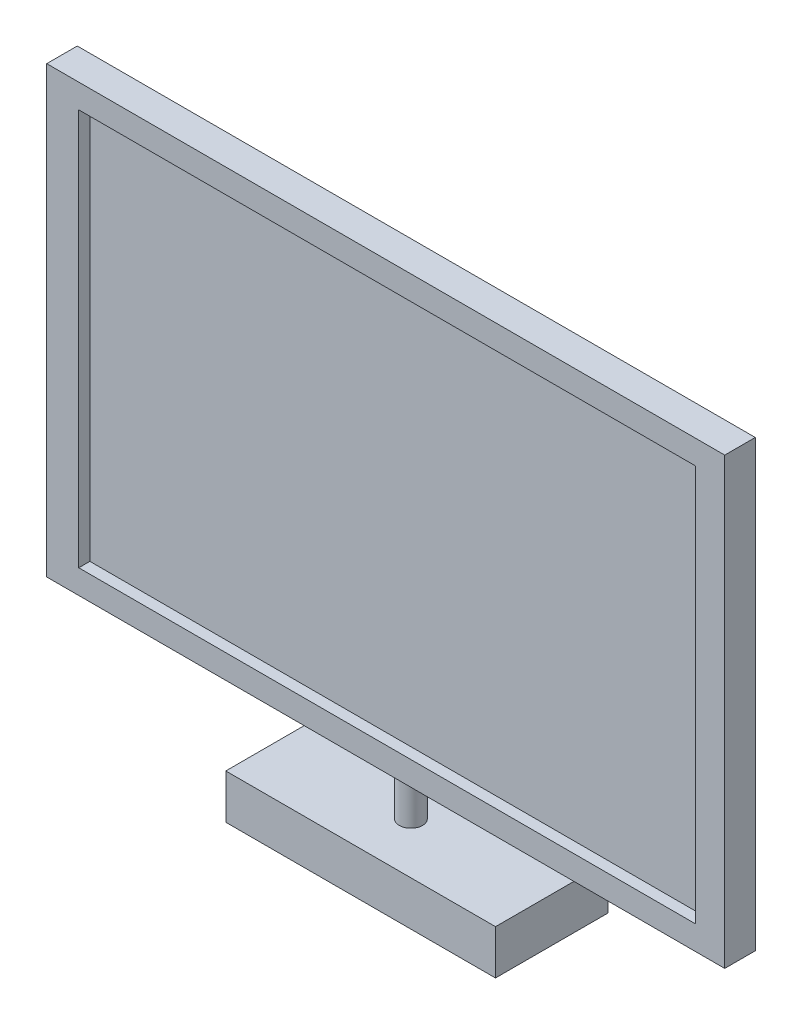
ISO-10303-21;
HEADER;
FILE_DESCRIPTION(('STEP AP214'),'2;1');
FILE_NAME('part.step','',(''),(''),'','','');
FILE_SCHEMA(('AUTOMOTIVE_DESIGN { 1 0 10303 214 1 1 1 1 }'));
ENDSEC;
DATA;
#1=APPLICATION_CONTEXT('core data for automotive mechanical design processes');
#2=APPLICATION_PROTOCOL_DEFINITION('international standard','automotive_design',2000,#1);
#3=PRODUCT_CONTEXT('',#1,'mechanical');
#4=PRODUCT('Part','Part','',(#3));
#5=PRODUCT_RELATED_PRODUCT_CATEGORY('part','',(#4));
#6=PRODUCT_DEFINITION_FORMATION('','',#4);
#7=PRODUCT_DEFINITION_CONTEXT('part definition',#1,'design');
#8=PRODUCT_DEFINITION('design','',#6,#7);
#9=PRODUCT_DEFINITION_SHAPE('','',#8);
#10=(LENGTH_UNIT() NAMED_UNIT(*) SI_UNIT(.MILLI.,.METRE.));
#11=(NAMED_UNIT(*) PLANE_ANGLE_UNIT() SI_UNIT($,.RADIAN.));
#12=(NAMED_UNIT(*) SI_UNIT($,.STERADIAN.) SOLID_ANGLE_UNIT());
#13=UNCERTAINTY_MEASURE_WITH_UNIT(LENGTH_MEASURE(1.E-05),#10,'distance_accuracy_value','');
#14=(GEOMETRIC_REPRESENTATION_CONTEXT(3) GLOBAL_UNCERTAINTY_ASSIGNED_CONTEXT((#13)) GLOBAL_UNIT_ASSIGNED_CONTEXT((#10,
#11,#12)) REPRESENTATION_CONTEXT('',''));
#15=CARTESIAN_POINT('',(0.,0.,0.));
#16=DIRECTION('',(0.,0.,1.));
#17=DIRECTION('',(1.,0.,0.));
#18=AXIS2_PLACEMENT_3D('',#15,#16,#17);
#19=CARTESIAN_POINT('',(549.,0.,0.));
#20=DIRECTION('',(0.,0.,-1.));
#21=DIRECTION('',(-1.,0.,0.));
#22=AXIS2_PLACEMENT_3D('',#19,#20,#21);
#23=PLANE('',#22);
#24=DIRECTION('',(1.,0.,0.));
#25=VECTOR('',#24,1.);
#26=CARTESIAN_POINT('',(25.920914996524,19.4294060743443,0.));
#27=LINE('',#26,#25);
#28=CARTESIAN_POINT('',(25.920914996524,19.4294060743443,0.));
#29=VERTEX_POINT('',#28);
#30=CARTESIAN_POINT('',(525.234394989055,19.4294060743443,0.));
#31=VERTEX_POINT('',#30);
#32=EDGE_CURVE('E179',#29,#31,#27,.T.);
#33=ORIENTED_EDGE('',*,*,#32,.F.);
#34=DIRECTION('',(0.,-1.,0.));
#35=VECTOR('',#34,1.);
#36=CARTESIAN_POINT('',(25.920914996524,340.570593925656,0.));
#37=LINE('',#36,#35);
#38=CARTESIAN_POINT('',(25.920914996524,340.570593925656,0.));
#39=VERTEX_POINT('',#38);
#40=EDGE_CURVE('E47',#39,#29,#37,.T.);
#41=ORIENTED_EDGE('',*,*,#40,.F.);
#42=DIRECTION('',(-1.,0.,0.));
#43=VECTOR('',#42,1.);
#44=CARTESIAN_POINT('',(25.920914996524,340.570593925656,0.));
#45=LINE('',#44,#43);
#46=CARTESIAN_POINT('',(525.234394989055,340.570593925656,0.));
#47=VERTEX_POINT('',#46);
#48=EDGE_CURVE('E168',#47,#39,#45,.T.);
#49=ORIENTED_EDGE('',*,*,#48,.F.);
#50=DIRECTION('',(0.,1.,0.));
#51=VECTOR('',#50,1.);
#52=CARTESIAN_POINT('',(525.234394989055,340.570593925656,0.));
#53=LINE('',#52,#51);
#54=EDGE_CURVE('E182',#31,#47,#53,.T.);
#55=ORIENTED_EDGE('',*,*,#54,.F.);
#56=EDGE_LOOP('',(#33,#41,#49,#55));
#57=FACE_BOUND('',#56,.T.);
#58=DIRECTION('',(0.,-1.,0.));
#59=VECTOR('',#58,1.);
#60=CARTESIAN_POINT('',(0.,0.,0.));
#61=LINE('',#60,#59);
#62=CARTESIAN_POINT('',(0.,360.,0.));
#63=VERTEX_POINT('',#62);
#64=CARTESIAN_POINT('',(0.,0.,0.));
#65=VERTEX_POINT('',#64);
#66=EDGE_CURVE('E189',#63,#65,#61,.T.);
#67=ORIENTED_EDGE('',*,*,#66,.T.);
#68=DIRECTION('',(-1.,0.,0.));
#69=VECTOR('',#68,1.);
#70=CARTESIAN_POINT('',(549.,0.,0.));
#71=LINE('',#70,#69);
#72=CARTESIAN_POINT('',(549.,0.,0.));
#73=VERTEX_POINT('',#72);
#74=EDGE_CURVE('E40',#73,#65,#71,.T.);
#75=ORIENTED_EDGE('',*,*,#74,.F.);
#76=DIRECTION('',(0.,-1.,0.));
#77=VECTOR('',#76,1.);
#78=CARTESIAN_POINT('',(549.,0.,0.));
#79=LINE('',#78,#77);
#80=CARTESIAN_POINT('',(549.,360.,0.));
#81=VERTEX_POINT('',#80);
#82=EDGE_CURVE('E195',#81,#73,#79,.T.);
#83=ORIENTED_EDGE('',*,*,#82,.F.);
#84=DIRECTION('',(-1.,0.,0.));
#85=VECTOR('',#84,1.);
#86=CARTESIAN_POINT('',(549.,360.,0.));
#87=LINE('',#86,#85);
#88=EDGE_CURVE('E201',#81,#63,#87,.T.);
#89=ORIENTED_EDGE('',*,*,#88,.T.);
#90=EDGE_LOOP('',(#67,#75,#83,#89));
#91=FACE_BOUND('',#90,.T.);
#92=ADVANCED_FACE('F33',(#57,#91),#23,.F.);
#93=CARTESIAN_POINT('',(549.,0.,0.));
#94=DIRECTION('',(0.,1.,0.));
#95=DIRECTION('',(0.,0.,1.));
#96=AXIS2_PLACEMENT_3D('',#93,#94,#95);
#97=PLANE('',#96);
#98=CARTESIAN_POINT('',(280.998241645605,0.,-13.9037508317556));
#99=DIRECTION('',(0.,1.,0.));
#100=DIRECTION('',(0.,0.,1.));
#101=AXIS2_PLACEMENT_3D('',#98,#99,#100);
#102=CIRCLE('',#101,9.40368931074854);
#103=CARTESIAN_POINT('',(280.998241645605,0.,-4.50006152100703));
#104=VERTEX_POINT('',#103);
#105=EDGE_CURVE('E11',#104,#104,#102,.F.);
#106=ORIENTED_EDGE('',*,*,#105,.F.);
#107=EDGE_LOOP('',(#106));
#108=FACE_BOUND('',#107,.T.);
#109=DIRECTION('',(0.,0.,-1.));
#110=VECTOR('',#109,1.);
#111=CARTESIAN_POINT('',(0.,0.,0.));
#112=LINE('',#111,#110);
#113=CARTESIAN_POINT('',(0.,0.,-24.7272727272728));
#114=VERTEX_POINT('',#113);
#115=EDGE_CURVE('E204',#65,#114,#112,.T.);
#116=ORIENTED_EDGE('',*,*,#115,.T.);
#117=DIRECTION('',(-1.,0.,0.));
#118=VECTOR('',#117,1.);
#119=CARTESIAN_POINT('',(549.,0.,-24.7272727272728));
#120=LINE('',#119,#118);
#121=CARTESIAN_POINT('',(549.,0.,-24.7272727272728));
#122=VERTEX_POINT('',#121);
#123=EDGE_CURVE('E212',#122,#114,#120,.T.);
#124=ORIENTED_EDGE('',*,*,#123,.F.);
#125=DIRECTION('',(0.,0.,-1.));
#126=VECTOR('',#125,1.);
#127=CARTESIAN_POINT('',(549.,0.,0.));
#128=LINE('',#127,#126);
#129=EDGE_CURVE('E85',#73,#122,#128,.T.);
#130=ORIENTED_EDGE('',*,*,#129,.F.);
#131=ORIENTED_EDGE('',*,*,#74,.T.);
#132=EDGE_LOOP('',(#116,#124,#130,#131));
#133=FACE_BOUND('',#132,.T.);
#134=ADVANCED_FACE('F215',(#108,#133),#97,.F.);
#135=CARTESIAN_POINT('',(549.,0.,-24.7272727272728));
#136=DIRECTION('',(0.,0.,1.));
#137=DIRECTION('',(1.,0.,0.));
#138=AXIS2_PLACEMENT_3D('',#135,#136,#137);
#139=PLANE('',#138);
#140=DIRECTION('',(0.,1.,0.));
#141=VECTOR('',#140,1.);
#142=CARTESIAN_POINT('',(0.,0.,-24.7272727272728));
#143=LINE('',#142,#141);
#144=CARTESIAN_POINT('',(0.,360.,-24.7272727272728));
#145=VERTEX_POINT('',#144);
#146=EDGE_CURVE('E206',#114,#145,#143,.T.);
#147=ORIENTED_EDGE('',*,*,#146,.T.);
#148=DIRECTION('',(-1.,0.,0.));
#149=VECTOR('',#148,1.);
#150=CARTESIAN_POINT('',(549.,360.,-24.7272727272728));
#151=LINE('',#150,#149);
#152=CARTESIAN_POINT('',(549.,360.,-24.7272727272728));
#153=VERTEX_POINT('',#152);
#154=EDGE_CURVE('E210',#153,#145,#151,.T.);
#155=ORIENTED_EDGE('',*,*,#154,.F.);
#156=DIRECTION('',(0.,1.,0.));
#157=VECTOR('',#156,1.);
#158=CARTESIAN_POINT('',(549.,0.,-24.7272727272728));
#159=LINE('',#158,#157);
#160=EDGE_CURVE('E198',#122,#153,#159,.T.);
#161=ORIENTED_EDGE('',*,*,#160,.F.);
#162=ORIENTED_EDGE('',*,*,#123,.T.);
#163=EDGE_LOOP('',(#147,#155,#161,#162));
#164=FACE_BOUND('',#163,.T.);
#165=ADVANCED_FACE('F224',(#164),#139,.F.);
#166=CARTESIAN_POINT('',(549.,360.,0.));
#167=DIRECTION('',(0.,-1.,0.));
#168=DIRECTION('',(0.,0.,-1.));
#169=AXIS2_PLACEMENT_3D('',#166,#167,#168);
#170=PLANE('',#169);
#171=DIRECTION('',(0.,0.,1.));
#172=VECTOR('',#171,1.);
#173=CARTESIAN_POINT('',(0.,360.,0.));
#174=LINE('',#173,#172);
#175=EDGE_CURVE('E77',#145,#63,#174,.T.);
#176=ORIENTED_EDGE('',*,*,#175,.T.);
#177=ORIENTED_EDGE('',*,*,#88,.F.);
#178=DIRECTION('',(0.,0.,1.));
#179=VECTOR('',#178,1.);
#180=CARTESIAN_POINT('',(549.,360.,0.));
#181=LINE('',#180,#179);
#182=EDGE_CURVE('E56',#153,#81,#181,.T.);
#183=ORIENTED_EDGE('',*,*,#182,.F.);
#184=ORIENTED_EDGE('',*,*,#154,.T.);
#185=EDGE_LOOP('',(#176,#177,#183,#184));
#186=FACE_BOUND('',#185,.T.);
#187=ADVANCED_FACE('F226',(#186),#170,.F.);
#188=CARTESIAN_POINT('',(549.,0.,0.));
#189=DIRECTION('',(-1.,0.,0.));
#190=DIRECTION('',(0.,0.,1.));
#191=AXIS2_PLACEMENT_3D('',#188,#189,#190);
#192=PLANE('',#191);
#193=ORIENTED_EDGE('',*,*,#82,.T.);
#194=ORIENTED_EDGE('',*,*,#129,.T.);
#195=ORIENTED_EDGE('',*,*,#160,.T.);
#196=ORIENTED_EDGE('',*,*,#182,.T.);
#197=EDGE_LOOP('',(#193,#194,#195,#196));
#198=FACE_BOUND('',#197,.T.);
#199=ADVANCED_FACE('F227',(#198),#192,.F.);
#200=CARTESIAN_POINT('',(0.,0.,0.));
#201=DIRECTION('',(-1.,0.,0.));
#202=DIRECTION('',(0.,0.,1.));
#203=AXIS2_PLACEMENT_3D('',#200,#201,#202);
#204=PLANE('',#203);
#205=ORIENTED_EDGE('',*,*,#66,.F.);
#206=ORIENTED_EDGE('',*,*,#175,.F.);
#207=ORIENTED_EDGE('',*,*,#146,.F.);
#208=ORIENTED_EDGE('',*,*,#115,.F.);
#209=EDGE_LOOP('',(#205,#206,#207,#208));
#210=FACE_BOUND('',#209,.T.);
#211=ADVANCED_FACE('F220',(#210),#204,.T.);
#212=CARTESIAN_POINT('',(25.920914996524,340.570593925656,-8.99999999999977));
#213=DIRECTION('',(-1.,0.,0.));
#214=DIRECTION('',(0.,0.,1.));
#215=AXIS2_PLACEMENT_3D('',#212,#213,#214);
#216=PLANE('',#215);
#217=ORIENTED_EDGE('',*,*,#40,.T.);
#218=DIRECTION('',(0.,0.,1.));
#219=VECTOR('',#218,1.);
#220=CARTESIAN_POINT('',(25.920914996524,19.4294060743443,-8.99999999999977));
#221=LINE('',#220,#219);
#222=CARTESIAN_POINT('',(25.920914996524,19.4294060743443,-8.99999999999977));
#223=VERTEX_POINT('',#222);
#224=EDGE_CURVE('E177',#223,#29,#221,.T.);
#225=ORIENTED_EDGE('',*,*,#224,.F.);
#226=DIRECTION('',(0.,-1.,0.));
#227=VECTOR('',#226,1.);
#228=CARTESIAN_POINT('',(25.920914996524,340.570593925656,-8.99999999999977));
#229=LINE('',#228,#227);
#230=CARTESIAN_POINT('',(25.920914996524,340.570593925656,-8.99999999999977));
#231=VERTEX_POINT('',#230);
#232=EDGE_CURVE('E164',#231,#223,#229,.T.);
#233=ORIENTED_EDGE('',*,*,#232,.F.);
#234=DIRECTION('',(0.,0.,1.));
#235=VECTOR('',#234,1.);
#236=CARTESIAN_POINT('',(25.920914996524,340.570593925656,-8.99999999999977));
#237=LINE('',#236,#235);
#238=EDGE_CURVE('E187',#231,#39,#237,.T.);
#239=ORIENTED_EDGE('',*,*,#238,.T.);
#240=EDGE_LOOP('',(#217,#225,#233,#239));
#241=FACE_BOUND('',#240,.T.);
#242=ADVANCED_FACE('F234',(#241),#216,.F.);
#243=CARTESIAN_POINT('',(25.920914996524,340.570593925656,-8.99999999999977));
#244=DIRECTION('',(0.,1.,0.));
#245=DIRECTION('',(0.,0.,1.));
#246=AXIS2_PLACEMENT_3D('',#243,#244,#245);
#247=PLANE('',#246);
#248=ORIENTED_EDGE('',*,*,#48,.T.);
#249=ORIENTED_EDGE('',*,*,#238,.F.);
#250=DIRECTION('',(-1.,0.,0.));
#251=VECTOR('',#250,1.);
#252=CARTESIAN_POINT('',(25.920914996524,340.570593925656,-8.99999999999977));
#253=LINE('',#252,#251);
#254=CARTESIAN_POINT('',(525.234394989055,340.570593925656,-8.99999999999977));
#255=VERTEX_POINT('',#254);
#256=EDGE_CURVE('E174',#255,#231,#253,.T.);
#257=ORIENTED_EDGE('',*,*,#256,.F.);
#258=DIRECTION('',(0.,0.,1.));
#259=VECTOR('',#258,1.);
#260=CARTESIAN_POINT('',(525.234394989055,340.570593925656,-8.99999999999977));
#261=LINE('',#260,#259);
#262=EDGE_CURVE('E190',#255,#47,#261,.T.);
#263=ORIENTED_EDGE('',*,*,#262,.T.);
#264=EDGE_LOOP('',(#248,#249,#257,#263));
#265=FACE_BOUND('',#264,.T.);
#266=ADVANCED_FACE('F256',(#265),#247,.F.);
#267=CARTESIAN_POINT('',(525.234394989055,340.570593925656,-8.99999999999977));
#268=DIRECTION('',(1.,0.,0.));
#269=DIRECTION('',(0.,0.,-1.));
#270=AXIS2_PLACEMENT_3D('',#267,#268,#269);
#271=PLANE('',#270);
#272=ORIENTED_EDGE('',*,*,#54,.T.);
#273=ORIENTED_EDGE('',*,*,#262,.F.);
#274=DIRECTION('',(0.,1.,0.));
#275=VECTOR('',#274,1.);
#276=CARTESIAN_POINT('',(525.234394989055,340.570593925656,-8.99999999999977));
#277=LINE('',#276,#275);
#278=CARTESIAN_POINT('',(525.234394989055,19.4294060743443,-8.99999999999977));
#279=VERTEX_POINT('',#278);
#280=EDGE_CURVE('E171',#279,#255,#277,.T.);
#281=ORIENTED_EDGE('',*,*,#280,.F.);
#282=DIRECTION('',(0.,0.,1.));
#283=VECTOR('',#282,1.);
#284=CARTESIAN_POINT('',(525.234394989055,19.4294060743443,-8.99999999999977));
#285=LINE('',#284,#283);
#286=EDGE_CURVE('E192',#279,#31,#285,.T.);
#287=ORIENTED_EDGE('',*,*,#286,.T.);
#288=EDGE_LOOP('',(#272,#273,#281,#287));
#289=FACE_BOUND('',#288,.T.);
#290=ADVANCED_FACE('F258',(#289),#271,.F.);
#291=CARTESIAN_POINT('',(25.920914996524,19.4294060743443,-8.99999999999977));
#292=DIRECTION('',(0.,-1.,0.));
#293=DIRECTION('',(0.,0.,-1.));
#294=AXIS2_PLACEMENT_3D('',#291,#292,#293);
#295=PLANE('',#294);
#296=ORIENTED_EDGE('',*,*,#32,.T.);
#297=ORIENTED_EDGE('',*,*,#286,.F.);
#298=DIRECTION('',(1.,0.,0.));
#299=VECTOR('',#298,1.);
#300=CARTESIAN_POINT('',(25.920914996524,19.4294060743443,-8.99999999999977));
#301=LINE('',#300,#299);
#302=EDGE_CURVE('E167',#223,#279,#301,.T.);
#303=ORIENTED_EDGE('',*,*,#302,.F.);
#304=ORIENTED_EDGE('',*,*,#224,.T.);
#305=EDGE_LOOP('',(#296,#297,#303,#304));
#306=FACE_BOUND('',#305,.T.);
#307=ADVANCED_FACE('F248',(#306),#295,.F.);
#308=CARTESIAN_POINT('',(0.,0.,-8.99999999999977));
#309=DIRECTION('',(0.,0.,1.));
#310=DIRECTION('',(1.,0.,0.));
#311=AXIS2_PLACEMENT_3D('',#308,#309,#310);
#312=PLANE('',#311);
#313=ORIENTED_EDGE('',*,*,#232,.T.);
#314=ORIENTED_EDGE('',*,*,#302,.T.);
#315=ORIENTED_EDGE('',*,*,#280,.T.);
#316=ORIENTED_EDGE('',*,*,#256,.T.);
#317=EDGE_LOOP('',(#313,#314,#315,#316));
#318=FACE_BOUND('',#317,.T.);
#319=ADVANCED_FACE('F254',(#318),#312,.T.);
#320=CARTESIAN_POINT('',(280.998241645605,-35.9999999999998,-13.9037508317556));
#321=DIRECTION('',(0.,1.,0.));
#322=DIRECTION('',(0.,0.,1.));
#323=AXIS2_PLACEMENT_3D('',#320,#321,#322);
#324=CYLINDRICAL_SURFACE('',#323,9.40368931074854);
#325=CARTESIAN_POINT('',(280.998241645605,-35.9999999999998,-13.9037508317556));
#326=DIRECTION('',(0.,-1.,0.));
#327=DIRECTION('',(0.,0.,-1.));
#328=AXIS2_PLACEMENT_3D('',#325,#326,#327);
#329=CIRCLE('',#328,9.40368931074854);
#330=CARTESIAN_POINT('',(280.998241645605,-35.9999999999998,-23.3074401425041));
#331=VERTEX_POINT('',#330);
#332=EDGE_CURVE('E156',#331,#331,#329,.T.);
#333=ORIENTED_EDGE('',*,*,#332,.F.);
#334=EDGE_LOOP('',(#333));
#335=FACE_BOUND('',#334,.T.);
#336=ORIENTED_EDGE('',*,*,#105,.T.);
#337=EDGE_LOOP('',(#336));
#338=FACE_BOUND('',#337,.T.);
#339=ADVANCED_FACE('F296',(#335,#338),#324,.T.);
#340=CARTESIAN_POINT('',(172.481994015915,-71.9999999999996,27.5095983695815));
#341=DIRECTION('',(1.,0.,0.));
#342=DIRECTION('',(0.,0.,-1.));
#343=AXIS2_PLACEMENT_3D('',#340,#341,#342);
#344=PLANE('',#343);
#345=DIRECTION('',(0.,0.,-1.));
#346=VECTOR('',#345,1.);
#347=CARTESIAN_POINT('',(172.481994015915,-35.9999999999998,27.5095983695815));
#348=LINE('',#347,#346);
#349=CARTESIAN_POINT('',(172.481994015915,-35.9999999999998,27.5095983695815));
#350=VERTEX_POINT('',#349);
#351=CARTESIAN_POINT('',(172.481994015915,-35.9999999999998,-63.7318576866077));
#352=VERTEX_POINT('',#351);
#353=EDGE_CURVE('E155',#350,#352,#348,.T.);
#354=ORIENTED_EDGE('',*,*,#353,.T.);
#355=DIRECTION('',(0.,1.,0.));
#356=VECTOR('',#355,1.);
#357=CARTESIAN_POINT('',(172.481994015915,-71.9999999999996,-63.7318576866077));
#358=LINE('',#357,#356);
#359=CARTESIAN_POINT('',(172.481994015915,-71.9999999999996,-63.7318576866077));
#360=VERTEX_POINT('',#359);
#361=EDGE_CURVE('E135',#360,#352,#358,.T.);
#362=ORIENTED_EDGE('',*,*,#361,.F.);
#363=DIRECTION('',(0.,0.,-1.));
#364=VECTOR('',#363,1.);
#365=CARTESIAN_POINT('',(172.481994015915,-71.9999999999996,27.5095983695815));
#366=LINE('',#365,#364);
#367=CARTESIAN_POINT('',(172.481994015915,-71.9999999999996,27.5095983695815));
#368=VERTEX_POINT('',#367);
#369=EDGE_CURVE('E142',#368,#360,#366,.T.);
#370=ORIENTED_EDGE('',*,*,#369,.F.);
#371=DIRECTION('',(0.,1.,0.));
#372=VECTOR('',#371,1.);
#373=CARTESIAN_POINT('',(172.481994015915,-71.9999999999996,27.5095983695815));
#374=LINE('',#373,#372);
#375=EDGE_CURVE('E384',#368,#350,#374,.T.);
#376=ORIENTED_EDGE('',*,*,#375,.T.);
#377=EDGE_LOOP('',(#354,#362,#370,#376));
#378=FACE_BOUND('',#377,.T.);
#379=ADVANCED_FACE('F153',(#378),#344,.F.);
#380=CARTESIAN_POINT('',(172.481994015915,-71.9999999999996,-63.7318576866077));
#381=DIRECTION('',(0.,0.,1.));
#382=DIRECTION('',(1.,0.,0.));
#383=AXIS2_PLACEMENT_3D('',#380,#381,#382);
#384=PLANE('',#383);
#385=DIRECTION('',(1.,0.,0.));
#386=VECTOR('',#385,1.);
#387=CARTESIAN_POINT('',(172.481994015915,-35.9999999999998,-63.7318576866077));
#388=LINE('',#387,#386);
#389=CARTESIAN_POINT('',(390.886739221281,-35.9999999999998,-63.7318576866077));
#390=VERTEX_POINT('',#389);
#391=EDGE_CURVE('E375',#352,#390,#388,.T.);
#392=ORIENTED_EDGE('',*,*,#391,.T.);
#393=DIRECTION('',(0.,1.,0.));
#394=VECTOR('',#393,1.);
#395=CARTESIAN_POINT('',(390.886739221281,-71.9999999999996,-63.7318576866077));
#396=LINE('',#395,#394);
#397=CARTESIAN_POINT('',(390.886739221281,-71.9999999999996,-63.7318576866077));
#398=VERTEX_POINT('',#397);
#399=EDGE_CURVE('E138',#398,#390,#396,.T.);
#400=ORIENTED_EDGE('',*,*,#399,.F.);
#401=DIRECTION('',(1.,0.,0.));
#402=VECTOR('',#401,1.);
#403=CARTESIAN_POINT('',(172.481994015915,-71.9999999999996,-63.7318576866077));
#404=LINE('',#403,#402);
#405=EDGE_CURVE('E131',#360,#398,#404,.T.);
#406=ORIENTED_EDGE('',*,*,#405,.F.);
#407=ORIENTED_EDGE('',*,*,#361,.T.);
#408=EDGE_LOOP('',(#392,#400,#406,#407));
#409=FACE_BOUND('',#408,.T.);
#410=ADVANCED_FACE('F133',(#409),#384,.F.);
#411=CARTESIAN_POINT('',(390.886739221281,-71.9999999999996,27.5095983695815));
#412=DIRECTION('',(-1.,0.,0.));
#413=DIRECTION('',(0.,0.,1.));
#414=AXIS2_PLACEMENT_3D('',#411,#412,#413);
#415=PLANE('',#414);
#416=DIRECTION('',(0.,0.,1.));
#417=VECTOR('',#416,1.);
#418=CARTESIAN_POINT('',(390.886739221281,-35.9999999999998,27.5095983695815));
#419=LINE('',#418,#417);
#420=CARTESIAN_POINT('',(390.886739221281,-35.9999999999998,27.5095983695815));
#421=VERTEX_POINT('',#420);
#422=EDGE_CURVE('E377',#390,#421,#419,.T.);
#423=ORIENTED_EDGE('',*,*,#422,.T.);
#424=DIRECTION('',(0.,1.,0.));
#425=VECTOR('',#424,1.);
#426=CARTESIAN_POINT('',(390.886739221281,-71.9999999999996,27.5095983695815));
#427=LINE('',#426,#425);
#428=CARTESIAN_POINT('',(390.886739221281,-71.9999999999996,27.5095983695815));
#429=VERTEX_POINT('',#428);
#430=EDGE_CURVE('E160',#429,#421,#427,.T.);
#431=ORIENTED_EDGE('',*,*,#430,.F.);
#432=DIRECTION('',(0.,0.,1.));
#433=VECTOR('',#432,1.);
#434=CARTESIAN_POINT('',(390.886739221281,-71.9999999999996,27.5095983695815));
#435=LINE('',#434,#433);
#436=EDGE_CURVE('E141',#398,#429,#435,.T.);
#437=ORIENTED_EDGE('',*,*,#436,.F.);
#438=ORIENTED_EDGE('',*,*,#399,.T.);
#439=EDGE_LOOP('',(#423,#431,#437,#438));
#440=FACE_BOUND('',#439,.T.);
#441=ADVANCED_FACE('F330',(#440),#415,.F.);
#442=CARTESIAN_POINT('',(172.481994015915,-71.9999999999996,27.5095983695815));
#443=DIRECTION('',(0.,0.,-1.));
#444=DIRECTION('',(-1.,0.,0.));
#445=AXIS2_PLACEMENT_3D('',#442,#443,#444);
#446=PLANE('',#445);
#447=DIRECTION('',(-1.,0.,0.));
#448=VECTOR('',#447,1.);
#449=CARTESIAN_POINT('',(172.481994015915,-35.9999999999998,27.5095983695815));
#450=LINE('',#449,#448);
#451=EDGE_CURVE('E151',#421,#350,#450,.T.);
#452=ORIENTED_EDGE('',*,*,#451,.T.);
#453=ORIENTED_EDGE('',*,*,#375,.F.);
#454=DIRECTION('',(-1.,0.,0.));
#455=VECTOR('',#454,1.);
#456=CARTESIAN_POINT('',(172.481994015915,-71.9999999999996,27.5095983695815));
#457=LINE('',#456,#455);
#458=EDGE_CURVE('E147',#429,#368,#457,.T.);
#459=ORIENTED_EDGE('',*,*,#458,.F.);
#460=ORIENTED_EDGE('',*,*,#430,.T.);
#461=EDGE_LOOP('',(#452,#453,#459,#460));
#462=FACE_BOUND('',#461,.T.);
#463=ADVANCED_FACE('F339',(#462),#446,.F.);
#464=CARTESIAN_POINT('',(0.,-71.9999999999996,0.));
#465=DIRECTION('',(0.,-1.,0.));
#466=DIRECTION('',(0.,0.,-1.));
#467=AXIS2_PLACEMENT_3D('',#464,#465,#466);
#468=PLANE('',#467);
#469=ORIENTED_EDGE('',*,*,#369,.T.);
#470=ORIENTED_EDGE('',*,*,#405,.T.);
#471=ORIENTED_EDGE('',*,*,#436,.T.);
#472=ORIENTED_EDGE('',*,*,#458,.T.);
#473=EDGE_LOOP('',(#469,#470,#471,#472));
#474=FACE_BOUND('',#473,.T.);
#475=ADVANCED_FACE('F145',(#474),#468,.T.);
#476=CARTESIAN_POINT('',(0.,-35.9999999999998,0.));
#477=DIRECTION('',(0.,-1.,0.));
#478=DIRECTION('',(0.,0.,-1.));
#479=AXIS2_PLACEMENT_3D('',#476,#477,#478);
#480=PLANE('',#479);
#481=ORIENTED_EDGE('',*,*,#332,.T.);
#482=EDGE_LOOP('',(#481));
#483=FACE_BOUND('',#482,.T.);
#484=ORIENTED_EDGE('',*,*,#353,.F.);
#485=ORIENTED_EDGE('',*,*,#451,.F.);
#486=ORIENTED_EDGE('',*,*,#422,.F.);
#487=ORIENTED_EDGE('',*,*,#391,.F.);
#488=EDGE_LOOP('',(#484,#485,#486,#487));
#489=FACE_BOUND('',#488,.T.);
#490=ADVANCED_FACE('F358',(#483,#489),#480,.F.);
#491=CLOSED_SHELL('',(#92,#134,#165,#187,#199,#211,#242,#266,#290,#307,#319,#339,#379,#410,#441,
#463,#475,#490));
#492=MANIFOLD_SOLID_BREP('B2',#491);
#493=ADVANCED_BREP_SHAPE_REPRESENTATION('',(#18,#492),#14);
#494=SHAPE_DEFINITION_REPRESENTATION(#9,#493);
ENDSEC;
END-ISO-10303-21;
